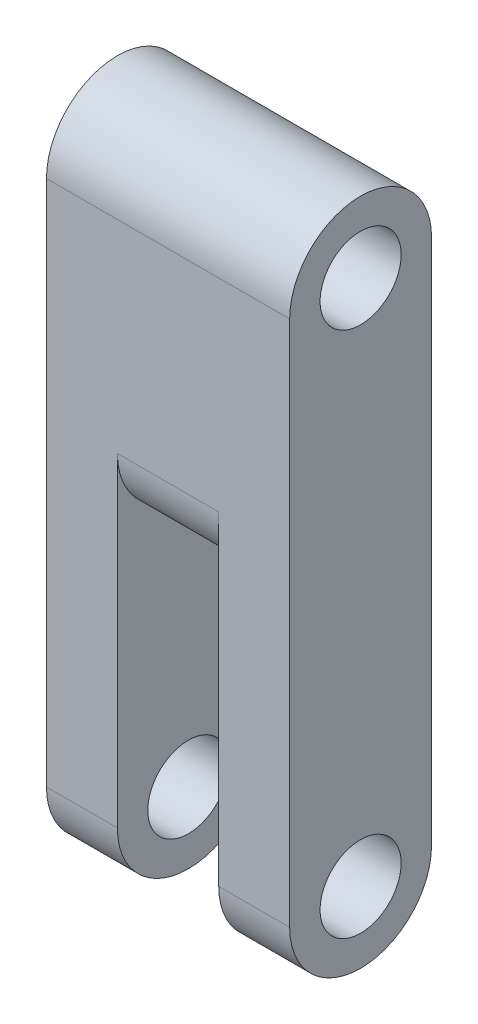
ISO-10303-21;
HEADER;
FILE_DESCRIPTION(('STEP AP214'),'2;1');
FILE_NAME('part.step','',(''),(''),'','','');
FILE_SCHEMA(('AUTOMOTIVE_DESIGN { 1 0 10303 214 1 1 1 1 }'));
ENDSEC;
DATA;
#1=APPLICATION_CONTEXT('core data for automotive mechanical design processes');
#2=APPLICATION_PROTOCOL_DEFINITION('international standard','automotive_design',2000,#1);
#3=PRODUCT_CONTEXT('',#1,'mechanical');
#4=PRODUCT('Part','Part','',(#3));
#5=PRODUCT_RELATED_PRODUCT_CATEGORY('part','',(#4));
#6=PRODUCT_DEFINITION_FORMATION('','',#4);
#7=PRODUCT_DEFINITION_CONTEXT('part definition',#1,'design');
#8=PRODUCT_DEFINITION('design','',#6,#7);
#9=PRODUCT_DEFINITION_SHAPE('','',#8);
#10=(LENGTH_UNIT() NAMED_UNIT(*) SI_UNIT(.MILLI.,.METRE.));
#11=(NAMED_UNIT(*) PLANE_ANGLE_UNIT() SI_UNIT($,.RADIAN.));
#12=(NAMED_UNIT(*) SI_UNIT($,.STERADIAN.) SOLID_ANGLE_UNIT());
#13=UNCERTAINTY_MEASURE_WITH_UNIT(LENGTH_MEASURE(1.E-05),#10,'distance_accuracy_value','');
#14=(GEOMETRIC_REPRESENTATION_CONTEXT(3) GLOBAL_UNCERTAINTY_ASSIGNED_CONTEXT((#13)) GLOBAL_UNIT_ASSIGNED_CONTEXT((#10,
#11,#12)) REPRESENTATION_CONTEXT('',''));
#15=CARTESIAN_POINT('',(0.,0.,0.));
#16=DIRECTION('',(0.,0.,1.));
#17=DIRECTION('',(1.,0.,0.));
#18=AXIS2_PLACEMENT_3D('',#15,#16,#17);
#19=CARTESIAN_POINT('',(12.,0.,-3.5));
#20=DIRECTION('',(-1.,0.,0.));
#21=DIRECTION('',(0.,0.,1.));
#22=AXIS2_PLACEMENT_3D('',#19,#20,#21);
#23=CYLINDRICAL_SURFACE('',#22,3.5);
#24=CARTESIAN_POINT('',(3.5,0.,-3.5));
#25=DIRECTION('',(1.,0.,0.));
#26=DIRECTION('',(0.,0.,-1.));
#27=AXIS2_PLACEMENT_3D('',#24,#25,#26);
#28=CIRCLE('',#27,3.5);
#29=CARTESIAN_POINT('',(3.5,0.,0.));
#30=VERTEX_POINT('',#29);
#31=CARTESIAN_POINT('',(3.5,0.,-7.));
#32=VERTEX_POINT('',#31);
#33=EDGE_CURVE('E140',#30,#32,#28,.T.);
#34=ORIENTED_EDGE('',*,*,#33,.F.);
#35=DIRECTION('',(-1.,0.,0.));
#36=VECTOR('',#35,1.);
#37=CARTESIAN_POINT('',(12.,0.,0.));
#38=LINE('',#37,#36);
#39=CARTESIAN_POINT('',(0.,0.,0.));
#40=VERTEX_POINT('',#39);
#41=EDGE_CURVE('E86',#30,#40,#38,.T.);
#42=ORIENTED_EDGE('',*,*,#41,.T.);
#43=CARTESIAN_POINT('',(0.,0.,-3.5));
#44=DIRECTION('',(1.,0.,0.));
#45=DIRECTION('',(0.,0.,-1.));
#46=AXIS2_PLACEMENT_3D('',#43,#44,#45);
#47=CIRCLE('',#46,3.5);
#48=CARTESIAN_POINT('',(0.,0.,-7.));
#49=VERTEX_POINT('',#48);
#50=EDGE_CURVE('E163',#40,#49,#47,.T.);
#51=ORIENTED_EDGE('',*,*,#50,.T.);
#52=DIRECTION('',(-1.,0.,0.));
#53=VECTOR('',#52,1.);
#54=CARTESIAN_POINT('',(12.,0.,-7.));
#55=LINE('',#54,#53);
#56=EDGE_CURVE('E46',#32,#49,#55,.T.);
#57=ORIENTED_EDGE('',*,*,#56,.F.);
#58=EDGE_LOOP('',(#34,#42,#51,#57));
#59=FACE_BOUND('',#58,.T.);
#60=ADVANCED_FACE('F37',(#59),#23,.T.);
#61=CARTESIAN_POINT('',(-3.,0.,-3.50000000000006));
#62=DIRECTION('',(1.,0.,0.));
#63=DIRECTION('',(0.,0.,-1.));
#64=AXIS2_PLACEMENT_3D('',#61,#62,#63);
#65=CYLINDRICAL_SURFACE('',#64,2.);
#66=CARTESIAN_POINT('',(0.,0.,-3.50000000000006));
#67=DIRECTION('',(1.,0.,0.));
#68=DIRECTION('',(0.,0.,-1.));
#69=AXIS2_PLACEMENT_3D('',#66,#67,#68);
#70=CIRCLE('',#69,2.);
#71=CARTESIAN_POINT('',(0.,0.,-5.50000000000006));
#72=VERTEX_POINT('',#71);
#73=EDGE_CURVE('E166',#72,#72,#70,.T.);
#74=ORIENTED_EDGE('',*,*,#73,.F.);
#75=EDGE_LOOP('',(#74));
#76=FACE_BOUND('',#75,.T.);
#77=CARTESIAN_POINT('',(3.5,0.,-3.50000000000006));
#78=DIRECTION('',(1.,0.,0.));
#79=DIRECTION('',(0.,0.,-1.));
#80=AXIS2_PLACEMENT_3D('',#77,#78,#79);
#81=CIRCLE('',#80,2.);
#82=CARTESIAN_POINT('',(3.5,0.,-5.50000000000006));
#83=VERTEX_POINT('',#82);
#84=EDGE_CURVE('E133',#83,#83,#81,.F.);
#85=ORIENTED_EDGE('',*,*,#84,.F.);
#86=EDGE_LOOP('',(#85));
#87=FACE_BOUND('',#86,.T.);
#88=ADVANCED_FACE('F187',(#76,#87),#65,.F.);
#89=CARTESIAN_POINT('',(12.,0.,0.));
#90=VERTEX_POINT('',#89);
#91=CARTESIAN_POINT('',(8.5,0.,0.));
#92=VERTEX_POINT('',#91);
#93=EDGE_CURVE('E63',#90,#92,#38,.T.);
#94=ORIENTED_EDGE('',*,*,#93,.T.);
#95=CARTESIAN_POINT('',(8.5,0.,-3.5));
#96=DIRECTION('',(1.,0.,0.));
#97=DIRECTION('',(0.,0.,-1.));
#98=AXIS2_PLACEMENT_3D('',#95,#96,#97);
#99=CIRCLE('',#98,3.5);
#100=CARTESIAN_POINT('',(8.5,0.,-7.));
#101=VERTEX_POINT('',#100);
#102=EDGE_CURVE('E121',#92,#101,#99,.T.);
#103=ORIENTED_EDGE('',*,*,#102,.T.);
#104=CARTESIAN_POINT('',(12.,0.,-7.));
#105=VERTEX_POINT('',#104);
#106=EDGE_CURVE('E11',#105,#101,#55,.T.);
#107=ORIENTED_EDGE('',*,*,#106,.F.);
#108=CARTESIAN_POINT('',(12.,0.,-3.5));
#109=DIRECTION('',(1.,0.,0.));
#110=DIRECTION('',(0.,0.,-1.));
#111=AXIS2_PLACEMENT_3D('',#108,#109,#110);
#112=CIRCLE('',#111,3.5);
#113=EDGE_CURVE('E154',#90,#105,#112,.T.);
#114=ORIENTED_EDGE('',*,*,#113,.F.);
#115=EDGE_LOOP('',(#94,#103,#107,#114));
#116=FACE_BOUND('',#115,.T.);
#117=ADVANCED_FACE('F39',(#116),#23,.T.);
#118=CARTESIAN_POINT('',(12.,0.,-7.));
#119=DIRECTION('',(0.,0.,1.));
#120=DIRECTION('',(1.,0.,0.));
#121=AXIS2_PLACEMENT_3D('',#118,#119,#120);
#122=PLANE('',#121);
#123=ORIENTED_EDGE('',*,*,#106,.T.);
#124=DIRECTION('',(0.,1.,0.));
#125=VECTOR('',#124,1.);
#126=CARTESIAN_POINT('',(8.5,0.,-7.));
#127=LINE('',#126,#125);
#128=CARTESIAN_POINT('',(8.5,16.,-7.));
#129=VERTEX_POINT('',#128);
#130=EDGE_CURVE('E145',#101,#129,#127,.T.);
#131=ORIENTED_EDGE('',*,*,#130,.T.);
#132=DIRECTION('',(-1.,0.,0.));
#133=VECTOR('',#132,1.);
#134=CARTESIAN_POINT('',(8.5,16.,-7.));
#135=LINE('',#134,#133);
#136=CARTESIAN_POINT('',(3.5,16.,-7.));
#137=VERTEX_POINT('',#136);
#138=EDGE_CURVE('E129',#129,#137,#135,.T.);
#139=ORIENTED_EDGE('',*,*,#138,.T.);
#140=DIRECTION('',(0.,1.,0.));
#141=VECTOR('',#140,1.);
#142=CARTESIAN_POINT('',(3.5,0.,-7.));
#143=LINE('',#142,#141);
#144=EDGE_CURVE('E142',#32,#137,#143,.T.);
#145=ORIENTED_EDGE('',*,*,#144,.F.);
#146=ORIENTED_EDGE('',*,*,#56,.T.);
#147=DIRECTION('',(0.,1.,0.));
#148=VECTOR('',#147,1.);
#149=CARTESIAN_POINT('',(0.,0.,-7.));
#150=LINE('',#149,#148);
#151=CARTESIAN_POINT('',(0.,26.,-7.));
#152=VERTEX_POINT('',#151);
#153=EDGE_CURVE('E165',#49,#152,#150,.T.);
#154=ORIENTED_EDGE('',*,*,#153,.T.);
#155=DIRECTION('',(-1.,0.,0.));
#156=VECTOR('',#155,1.);
#157=CARTESIAN_POINT('',(12.,26.,-7.));
#158=LINE('',#157,#156);
#159=CARTESIAN_POINT('',(12.,26.,-7.));
#160=VERTEX_POINT('',#159);
#161=EDGE_CURVE('E177',#160,#152,#158,.T.);
#162=ORIENTED_EDGE('',*,*,#161,.F.);
#163=DIRECTION('',(0.,1.,0.));
#164=VECTOR('',#163,1.);
#165=CARTESIAN_POINT('',(12.,0.,-7.));
#166=LINE('',#165,#164);
#167=EDGE_CURVE('E93',#105,#160,#166,.T.);
#168=ORIENTED_EDGE('',*,*,#167,.F.);
#169=EDGE_LOOP('',(#123,#131,#139,#145,#146,#154,#162,#168));
#170=FACE_BOUND('',#169,.T.);
#171=ADVANCED_FACE('F199',(#170),#122,.F.);
#172=CARTESIAN_POINT('',(12.,26.,-3.5));
#173=DIRECTION('',(-1.,0.,0.));
#174=DIRECTION('',(0.,0.,1.));
#175=AXIS2_PLACEMENT_3D('',#172,#173,#174);
#176=CYLINDRICAL_SURFACE('',#175,3.5);
#177=CARTESIAN_POINT('',(0.,26.,-3.5));
#178=DIRECTION('',(-1.,0.,0.));
#179=DIRECTION('',(0.,0.,1.));
#180=AXIS2_PLACEMENT_3D('',#177,#178,#179);
#181=CIRCLE('',#180,3.5);
#182=CARTESIAN_POINT('',(0.,26.,0.));
#183=VERTEX_POINT('',#182);
#184=EDGE_CURVE('E169',#183,#152,#181,.T.);
#185=ORIENTED_EDGE('',*,*,#184,.F.);
#186=DIRECTION('',(-1.,0.,0.));
#187=VECTOR('',#186,1.);
#188=CARTESIAN_POINT('',(12.,26.,0.));
#189=LINE('',#188,#187);
#190=CARTESIAN_POINT('',(12.,26.,0.));
#191=VERTEX_POINT('',#190);
#192=EDGE_CURVE('E175',#191,#183,#189,.T.);
#193=ORIENTED_EDGE('',*,*,#192,.F.);
#194=CARTESIAN_POINT('',(12.,26.,-3.5));
#195=DIRECTION('',(-1.,0.,0.));
#196=DIRECTION('',(0.,0.,1.));
#197=AXIS2_PLACEMENT_3D('',#194,#195,#196);
#198=CIRCLE('',#197,3.5);
#199=EDGE_CURVE('E158',#191,#160,#198,.T.);
#200=ORIENTED_EDGE('',*,*,#199,.T.);
#201=ORIENTED_EDGE('',*,*,#161,.T.);
#202=EDGE_LOOP('',(#185,#193,#200,#201));
#203=FACE_BOUND('',#202,.T.);
#204=ADVANCED_FACE('F209',(#203),#176,.T.);
#205=CARTESIAN_POINT('',(12.,0.,0.));
#206=DIRECTION('',(0.,0.,1.));
#207=DIRECTION('',(1.,0.,0.));
#208=AXIS2_PLACEMENT_3D('',#205,#206,#207);
#209=PLANE('',#208);
#210=DIRECTION('',(0.,1.,0.));
#211=VECTOR('',#210,1.);
#212=CARTESIAN_POINT('',(8.5,0.,0.));
#213=LINE('',#212,#211);
#214=CARTESIAN_POINT('',(8.5,16.,0.));
#215=VERTEX_POINT('',#214);
#216=EDGE_CURVE('E115',#92,#215,#213,.T.);
#217=ORIENTED_EDGE('',*,*,#216,.F.);
#218=ORIENTED_EDGE('',*,*,#93,.F.);
#219=DIRECTION('',(0.,1.,0.));
#220=VECTOR('',#219,1.);
#221=CARTESIAN_POINT('',(12.,0.,0.));
#222=LINE('',#221,#220);
#223=EDGE_CURVE('E161',#90,#191,#222,.T.);
#224=ORIENTED_EDGE('',*,*,#223,.T.);
#225=ORIENTED_EDGE('',*,*,#192,.T.);
#226=DIRECTION('',(0.,1.,0.));
#227=VECTOR('',#226,1.);
#228=CARTESIAN_POINT('',(0.,0.,0.));
#229=LINE('',#228,#227);
#230=EDGE_CURVE('E156',#40,#183,#229,.T.);
#231=ORIENTED_EDGE('',*,*,#230,.F.);
#232=ORIENTED_EDGE('',*,*,#41,.F.);
#233=DIRECTION('',(0.,1.,0.));
#234=VECTOR('',#233,1.);
#235=CARTESIAN_POINT('',(3.5,0.,0.));
#236=LINE('',#235,#234);
#237=CARTESIAN_POINT('',(3.5,16.,0.));
#238=VERTEX_POINT('',#237);
#239=EDGE_CURVE('E132',#30,#238,#236,.T.);
#240=ORIENTED_EDGE('',*,*,#239,.T.);
#241=DIRECTION('',(-1.,0.,0.));
#242=VECTOR('',#241,1.);
#243=CARTESIAN_POINT('',(8.5,16.,0.));
#244=LINE('',#243,#242);
#245=EDGE_CURVE('E126',#215,#238,#244,.T.);
#246=ORIENTED_EDGE('',*,*,#245,.F.);
#247=EDGE_LOOP('',(#217,#218,#224,#225,#231,#232,#240,#246));
#248=FACE_BOUND('',#247,.T.);
#249=ADVANCED_FACE('F131',(#248),#209,.T.);
#250=CARTESIAN_POINT('',(12.,0.,-3.5));
#251=DIRECTION('',(1.,0.,0.));
#252=DIRECTION('',(0.,0.,-1.));
#253=AXIS2_PLACEMENT_3D('',#250,#251,#252);
#254=PLANE('',#253);
#255=CARTESIAN_POINT('',(12.,0.,-3.50000000000006));
#256=DIRECTION('',(1.,0.,0.));
#257=DIRECTION('',(0.,0.,-1.));
#258=AXIS2_PLACEMENT_3D('',#255,#256,#257);
#259=CIRCLE('',#258,2.);
#260=CARTESIAN_POINT('',(12.,0.,-5.50000000000006));
#261=VERTEX_POINT('',#260);
#262=EDGE_CURVE('E148',#261,#261,#259,.T.);
#263=ORIENTED_EDGE('',*,*,#262,.F.);
#264=EDGE_LOOP('',(#263));
#265=FACE_BOUND('',#264,.T.);
#266=CARTESIAN_POINT('',(12.,26.,-3.5));
#267=DIRECTION('',(1.,0.,0.));
#268=DIRECTION('',(0.,0.,-1.));
#269=AXIS2_PLACEMENT_3D('',#266,#267,#268);
#270=CIRCLE('',#269,2.);
#271=CARTESIAN_POINT('',(12.,26.,-5.5));
#272=VERTEX_POINT('',#271);
#273=EDGE_CURVE('E147',#272,#272,#270,.T.);
#274=ORIENTED_EDGE('',*,*,#273,.F.);
#275=EDGE_LOOP('',(#274));
#276=FACE_BOUND('',#275,.T.);
#277=ORIENTED_EDGE('',*,*,#113,.T.);
#278=ORIENTED_EDGE('',*,*,#167,.T.);
#279=ORIENTED_EDGE('',*,*,#199,.F.);
#280=ORIENTED_EDGE('',*,*,#223,.F.);
#281=EDGE_LOOP('',(#277,#278,#279,#280));
#282=FACE_BOUND('',#281,.T.);
#283=ADVANCED_FACE('F205',(#265,#276,#282),#254,.T.);
#284=CARTESIAN_POINT('',(0.,0.,-3.5));
#285=DIRECTION('',(1.,0.,0.));
#286=DIRECTION('',(0.,0.,-1.));
#287=AXIS2_PLACEMENT_3D('',#284,#285,#286);
#288=PLANE('',#287);
#289=ORIENTED_EDGE('',*,*,#73,.T.);
#290=EDGE_LOOP('',(#289));
#291=FACE_BOUND('',#290,.T.);
#292=CARTESIAN_POINT('',(0.,26.,-3.5));
#293=DIRECTION('',(1.,0.,0.));
#294=DIRECTION('',(0.,0.,-1.));
#295=AXIS2_PLACEMENT_3D('',#292,#293,#294);
#296=CIRCLE('',#295,2.);
#297=CARTESIAN_POINT('',(0.,26.,-5.5));
#298=VERTEX_POINT('',#297);
#299=EDGE_CURVE('E151',#298,#298,#296,.T.);
#300=ORIENTED_EDGE('',*,*,#299,.T.);
#301=EDGE_LOOP('',(#300));
#302=FACE_BOUND('',#301,.T.);
#303=ORIENTED_EDGE('',*,*,#50,.F.);
#304=ORIENTED_EDGE('',*,*,#230,.T.);
#305=ORIENTED_EDGE('',*,*,#184,.T.);
#306=ORIENTED_EDGE('',*,*,#153,.F.);
#307=EDGE_LOOP('',(#303,#304,#305,#306));
#308=FACE_BOUND('',#307,.T.);
#309=ADVANCED_FACE('F184',(#291,#302,#308),#288,.F.);
#310=CARTESIAN_POINT('',(-3.,26.,-3.5));
#311=DIRECTION('',(1.,0.,0.));
#312=DIRECTION('',(0.,0.,-1.));
#313=AXIS2_PLACEMENT_3D('',#310,#311,#312);
#314=CYLINDRICAL_SURFACE('',#313,2.);
#315=ORIENTED_EDGE('',*,*,#273,.T.);
#316=EDGE_LOOP('',(#315));
#317=FACE_BOUND('',#316,.T.);
#318=ORIENTED_EDGE('',*,*,#299,.F.);
#319=EDGE_LOOP('',(#318));
#320=FACE_BOUND('',#319,.T.);
#321=ADVANCED_FACE('F228',(#317,#320),#314,.F.);
#322=CARTESIAN_POINT('',(8.5,0.,-3.50000000000006));
#323=DIRECTION('',(1.,0.,0.));
#324=DIRECTION('',(0.,0.,-1.));
#325=AXIS2_PLACEMENT_3D('',#322,#323,#324);
#326=CIRCLE('',#325,2.);
#327=CARTESIAN_POINT('',(8.5,0.,-5.50000000000006));
#328=VERTEX_POINT('',#327);
#329=EDGE_CURVE('E41',#328,#328,#326,.F.);
#330=ORIENTED_EDGE('',*,*,#329,.T.);
#331=EDGE_LOOP('',(#330));
#332=FACE_BOUND('',#331,.T.);
#333=ORIENTED_EDGE('',*,*,#262,.T.);
#334=EDGE_LOOP('',(#333));
#335=FACE_BOUND('',#334,.T.);
#336=ADVANCED_FACE('F191',(#332,#335),#65,.F.);
#337=CARTESIAN_POINT('',(8.5,16.,-3.5));
#338=DIRECTION('',(1.,0.,0.));
#339=DIRECTION('',(0.,0.,-1.));
#340=AXIS2_PLACEMENT_3D('',#337,#338,#339);
#341=PLANE('',#340);
#342=ORIENTED_EDGE('',*,*,#329,.F.);
#343=EDGE_LOOP('',(#342));
#344=FACE_BOUND('',#343,.T.);
#345=ORIENTED_EDGE('',*,*,#102,.F.);
#346=ORIENTED_EDGE('',*,*,#216,.T.);
#347=CARTESIAN_POINT('',(8.5,16.,-3.5));
#348=DIRECTION('',(-1.,0.,0.));
#349=DIRECTION('',(0.,0.,-1.));
#350=AXIS2_PLACEMENT_3D('',#347,#348,#349);
#351=CIRCLE('',#350,3.5);
#352=EDGE_CURVE('E118',#129,#215,#351,.T.);
#353=ORIENTED_EDGE('',*,*,#352,.F.);
#354=ORIENTED_EDGE('',*,*,#130,.F.);
#355=EDGE_LOOP('',(#345,#346,#353,#354));
#356=FACE_BOUND('',#355,.T.);
#357=ADVANCED_FACE('F117',(#344,#356),#341,.F.);
#358=CARTESIAN_POINT('',(3.5,16.,-3.5));
#359=DIRECTION('',(1.,0.,0.));
#360=DIRECTION('',(0.,0.,-1.));
#361=AXIS2_PLACEMENT_3D('',#358,#359,#360);
#362=PLANE('',#361);
#363=ORIENTED_EDGE('',*,*,#84,.T.);
#364=EDGE_LOOP('',(#363));
#365=FACE_BOUND('',#364,.T.);
#366=ORIENTED_EDGE('',*,*,#144,.T.);
#367=CARTESIAN_POINT('',(3.5,16.,-3.5));
#368=DIRECTION('',(-1.,0.,0.));
#369=DIRECTION('',(0.,0.,-1.));
#370=AXIS2_PLACEMENT_3D('',#367,#368,#369);
#371=CIRCLE('',#370,3.5);
#372=EDGE_CURVE('E54',#137,#238,#371,.T.);
#373=ORIENTED_EDGE('',*,*,#372,.T.);
#374=ORIENTED_EDGE('',*,*,#239,.F.);
#375=ORIENTED_EDGE('',*,*,#33,.T.);
#376=EDGE_LOOP('',(#366,#373,#374,#375));
#377=FACE_BOUND('',#376,.T.);
#378=ADVANCED_FACE('F194',(#365,#377),#362,.T.);
#379=CARTESIAN_POINT('',(8.5,16.,-3.5));
#380=DIRECTION('',(-1.,0.,0.));
#381=DIRECTION('',(0.,0.,1.));
#382=AXIS2_PLACEMENT_3D('',#379,#380,#381);
#383=CYLINDRICAL_SURFACE('',#382,3.5);
#384=ORIENTED_EDGE('',*,*,#372,.F.);
#385=ORIENTED_EDGE('',*,*,#138,.F.);
#386=ORIENTED_EDGE('',*,*,#352,.T.);
#387=ORIENTED_EDGE('',*,*,#245,.T.);
#388=EDGE_LOOP('',(#384,#385,#386,#387));
#389=FACE_BOUND('',#388,.T.);
#390=ADVANCED_FACE('F125',(#389),#383,.T.);
#391=CLOSED_SHELL('',(#60,#88,#117,#171,#204,#249,#283,#309,#321,#336,#357,#378,#390));
#392=MANIFOLD_SOLID_BREP('B2',#391);
#393=ADVANCED_BREP_SHAPE_REPRESENTATION('',(#18,#392),#14);
#394=SHAPE_DEFINITION_REPRESENTATION(#9,#393);
ENDSEC;
END-ISO-10303-21;
